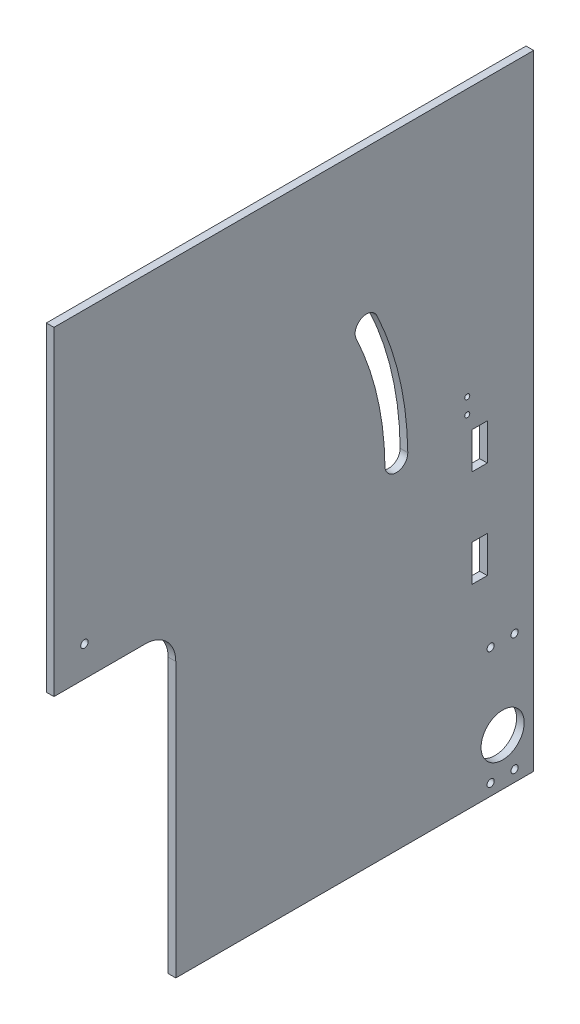
ISO-10303-21;
HEADER;
FILE_DESCRIPTION(('STEP AP214'),'2;1');
FILE_NAME('part.step','',(''),(''),'','','');
FILE_SCHEMA(('AUTOMOTIVE_DESIGN { 1 0 10303 214 1 1 1 1 }'));
ENDSEC;
DATA;
#1=APPLICATION_CONTEXT('core data for automotive mechanical design processes');
#2=APPLICATION_PROTOCOL_DEFINITION('international standard','automotive_design',2000,#1);
#3=PRODUCT_CONTEXT('',#1,'mechanical');
#4=PRODUCT('Part','Part','',(#3));
#5=PRODUCT_RELATED_PRODUCT_CATEGORY('part','',(#4));
#6=PRODUCT_DEFINITION_FORMATION('','',#4);
#7=PRODUCT_DEFINITION_CONTEXT('part definition',#1,'design');
#8=PRODUCT_DEFINITION('design','',#6,#7);
#9=PRODUCT_DEFINITION_SHAPE('','',#8);
#10=(LENGTH_UNIT() NAMED_UNIT(*) SI_UNIT(.MILLI.,.METRE.));
#11=(NAMED_UNIT(*) PLANE_ANGLE_UNIT() SI_UNIT($,.RADIAN.));
#12=(NAMED_UNIT(*) SI_UNIT($,.STERADIAN.) SOLID_ANGLE_UNIT());
#13=UNCERTAINTY_MEASURE_WITH_UNIT(LENGTH_MEASURE(1.E-05),#10,'distance_accuracy_value','');
#14=(GEOMETRIC_REPRESENTATION_CONTEXT(3) GLOBAL_UNCERTAINTY_ASSIGNED_CONTEXT((#13)) GLOBAL_UNIT_ASSIGNED_CONTEXT((#10,
#11,#12)) REPRESENTATION_CONTEXT('',''));
#15=CARTESIAN_POINT('',(0.,0.,0.));
#16=DIRECTION('',(0.,0.,1.));
#17=DIRECTION('',(1.,0.,0.));
#18=AXIS2_PLACEMENT_3D('',#15,#16,#17);
#19=CARTESIAN_POINT('',(3.175,0.,0.));
#20=DIRECTION('',(1.,0.,0.));
#21=DIRECTION('',(0.,0.,-1.));
#22=AXIS2_PLACEMENT_3D('',#19,#20,#21);
#23=PLANE('',#22);
#24=CARTESIAN_POINT('',(3.175,-76.4125,-82.075));
#25=DIRECTION('',(1.,0.,0.));
#26=DIRECTION('',(0.,0.,-1.));
#27=AXIS2_PLACEMENT_3D('',#24,#25,#26);
#28=CIRCLE('',#27,1.5);
#29=CARTESIAN_POINT('',(3.175,-76.4125,-83.575));
#30=VERTEX_POINT('',#29);
#31=EDGE_CURVE('E771',#30,#30,#28,.T.);
#32=ORIENTED_EDGE('',*,*,#31,.F.);
#33=EDGE_LOOP('',(#32));
#34=FACE_BOUND('',#33,.T.);
#35=CARTESIAN_POINT('',(3.175,-125.4125,-92.075));
#36=DIRECTION('',(1.,0.,0.));
#37=DIRECTION('',(0.,0.,-1.));
#38=AXIS2_PLACEMENT_3D('',#35,#36,#37);
#39=CIRCLE('',#38,1.5);
#40=CARTESIAN_POINT('',(3.175,-125.4125,-93.575));
#41=VERTEX_POINT('',#40);
#42=EDGE_CURVE('E780',#41,#41,#39,.T.);
#43=ORIENTED_EDGE('',*,*,#42,.F.);
#44=EDGE_LOOP('',(#43));
#45=FACE_BOUND('',#44,.T.);
#46=CARTESIAN_POINT('',(3.175,-76.4125,-92.075));
#47=DIRECTION('',(1.,0.,0.));
#48=DIRECTION('',(0.,0.,-1.));
#49=AXIS2_PLACEMENT_3D('',#46,#47,#48);
#50=CIRCLE('',#49,1.5);
#51=CARTESIAN_POINT('',(3.175,-76.4125,-93.575));
#52=VERTEX_POINT('',#51);
#53=EDGE_CURVE('E846',#52,#52,#50,.T.);
#54=ORIENTED_EDGE('',*,*,#53,.F.);
#55=EDGE_LOOP('',(#54));
#56=FACE_BOUND('',#55,.T.);
#57=CARTESIAN_POINT('',(3.175,-110.5624916,-87.075));
#58=DIRECTION('',(1.,0.,0.));
#59=DIRECTION('',(0.,0.,-1.));
#60=AXIS2_PLACEMENT_3D('',#57,#58,#59);
#61=CIRCLE('',#60,8.99999999999999);
#62=CARTESIAN_POINT('',(3.175,-110.5624916,-96.075));
#63=VERTEX_POINT('',#62);
#64=EDGE_CURVE('E858',#63,#63,#61,.T.);
#65=ORIENTED_EDGE('',*,*,#64,.F.);
#66=EDGE_LOOP('',(#65));
#67=FACE_BOUND('',#66,.T.);
#68=CARTESIAN_POINT('',(3.175,-125.4125,-82.075));
#69=DIRECTION('',(1.,0.,0.));
#70=DIRECTION('',(0.,0.,-1.));
#71=AXIS2_PLACEMENT_3D('',#68,#69,#70);
#72=CIRCLE('',#71,1.5);
#73=CARTESIAN_POINT('',(3.175,-125.4125,-83.575));
#74=VERTEX_POINT('',#73);
#75=EDGE_CURVE('E202',#74,#74,#72,.T.);
#76=ORIENTED_EDGE('',*,*,#75,.F.);
#77=EDGE_LOOP('',(#76));
#78=FACE_BOUND('',#77,.T.);
#79=DIRECTION('',(0.,-1.,0.));
#80=VECTOR('',#79,1.);
#81=CARTESIAN_POINT('',(3.175,6.07499420000002,-74.3175));
#82=LINE('',#81,#80);
#83=CARTESIAN_POINT('',(3.175,6.07499420000002,-74.3175));
#84=VERTEX_POINT('',#83);
#85=CARTESIAN_POINT('',(3.175,-9.16500579999998,-74.3175));
#86=VERTEX_POINT('',#85);
#87=EDGE_CURVE('E55',#84,#86,#82,.T.);
#88=ORIENTED_EDGE('',*,*,#87,.F.);
#89=DIRECTION('',(0.,0.,1.));
#90=VECTOR('',#89,1.);
#91=CARTESIAN_POINT('',(3.175,6.07499420000002,-74.3175));
#92=LINE('',#91,#90);
#93=CARTESIAN_POINT('',(3.175,6.07499420000002,-80.6675));
#94=VERTEX_POINT('',#93);
#95=EDGE_CURVE('E194',#94,#84,#92,.T.);
#96=ORIENTED_EDGE('',*,*,#95,.F.);
#97=DIRECTION('',(0.,1.,0.));
#98=VECTOR('',#97,1.);
#99=CARTESIAN_POINT('',(3.175,6.07499420000002,-80.6675));
#100=LINE('',#99,#98);
#101=CARTESIAN_POINT('',(3.175,-9.16500579999998,-80.6675));
#102=VERTEX_POINT('',#101);
#103=EDGE_CURVE('E199',#102,#94,#100,.T.);
#104=ORIENTED_EDGE('',*,*,#103,.F.);
#105=DIRECTION('',(0.,0.,-1.));
#106=VECTOR('',#105,1.);
#107=CARTESIAN_POINT('',(3.175,-9.16500579999998,-74.3175));
#108=LINE('',#107,#106);
#109=EDGE_CURVE('E211',#86,#102,#108,.T.);
#110=ORIENTED_EDGE('',*,*,#109,.F.);
#111=EDGE_LOOP('',(#88,#96,#104,#110));
#112=FACE_BOUND('',#111,.T.);
#113=DIRECTION('',(0.,-1.,0.));
#114=VECTOR('',#113,1.);
#115=CARTESIAN_POINT('',(3.175,-34.5650058,-74.3175));
#116=LINE('',#115,#114);
#117=CARTESIAN_POINT('',(3.175,-34.5650058,-74.3175));
#118=VERTEX_POINT('',#117);
#119=CARTESIAN_POINT('',(3.175,-49.8050058,-74.3175));
#120=VERTEX_POINT('',#119);
#121=EDGE_CURVE('E63',#118,#120,#116,.T.);
#122=ORIENTED_EDGE('',*,*,#121,.F.);
#123=DIRECTION('',(0.,0.,1.));
#124=VECTOR('',#123,1.);
#125=CARTESIAN_POINT('',(3.175,-34.5650058,-74.3175));
#126=LINE('',#125,#124);
#127=CARTESIAN_POINT('',(3.175,-34.5650058,-80.6675));
#128=VERTEX_POINT('',#127);
#129=EDGE_CURVE('E232',#128,#118,#126,.T.);
#130=ORIENTED_EDGE('',*,*,#129,.F.);
#131=DIRECTION('',(0.,1.,0.));
#132=VECTOR('',#131,1.);
#133=CARTESIAN_POINT('',(3.175,-34.5650058,-80.6675));
#134=LINE('',#133,#132);
#135=CARTESIAN_POINT('',(3.175,-49.8050058,-80.6675));
#136=VERTEX_POINT('',#135);
#137=EDGE_CURVE('E252',#136,#128,#134,.T.);
#138=ORIENTED_EDGE('',*,*,#137,.F.);
#139=DIRECTION('',(0.,0.,-1.));
#140=VECTOR('',#139,1.);
#141=CARTESIAN_POINT('',(3.175,-49.8050058,-74.3175));
#142=LINE('',#141,#140);
#143=EDGE_CURVE('E247',#120,#136,#142,.T.);
#144=ORIENTED_EDGE('',*,*,#143,.F.);
#145=EDGE_LOOP('',(#122,#130,#138,#144));
#146=FACE_BOUND('',#145,.T.);
#147=CARTESIAN_POINT('',(3.175,12.4249942,-72.3175));
#148=DIRECTION('',(-1.,0.,0.));
#149=DIRECTION('',(0.,0.,1.));
#150=AXIS2_PLACEMENT_3D('',#147,#148,#149);
#151=CIRCLE('',#150,1.04999790000001);
#152=CARTESIAN_POINT('',(3.175,12.4249942,-71.2675021));
#153=VERTEX_POINT('',#152);
#154=EDGE_CURVE('E351',#153,#153,#151,.T.);
#155=ORIENTED_EDGE('',*,*,#154,.T.);
#156=EDGE_LOOP('',(#155));
#157=FACE_BOUND('',#156,.T.);
#158=CARTESIAN_POINT('',(3.175,18.9250066,-72.3175));
#159=DIRECTION('',(-1.,0.,0.));
#160=DIRECTION('',(0.,0.,1.));
#161=AXIS2_PLACEMENT_3D('',#158,#159,#160);
#162=CIRCLE('',#161,1.04999790000001);
#163=CARTESIAN_POINT('',(3.175,18.9250066,-71.2675021));
#164=VERTEX_POINT('',#163);
#165=EDGE_CURVE('E343',#164,#164,#162,.T.);
#166=ORIENTED_EDGE('',*,*,#165,.T.);
#167=EDGE_LOOP('',(#166));
#168=FACE_BOUND('',#167,.T.);
#169=CARTESIAN_POINT('',(3.175,9.52500000000001,87.3125));
#170=DIRECTION('',(-1.,0.,0.));
#171=DIRECTION('',(0.,0.,1.));
#172=AXIS2_PLACEMENT_3D('',#169,#170,#171);
#173=CIRCLE('',#172,1.54999999999999);
#174=CARTESIAN_POINT('',(3.175,9.52500000000001,88.8625));
#175=VERTEX_POINT('',#174);
#176=EDGE_CURVE('E334',#175,#175,#173,.T.);
#177=ORIENTED_EDGE('',*,*,#176,.T.);
#178=EDGE_LOOP('',(#177));
#179=FACE_BOUND('',#178,.T.);
#180=DIRECTION('',(0.,0.,-1.));
#181=VECTOR('',#180,1.);
#182=CARTESIAN_POINT('',(3.175,-3.17499999999999,100.0125));
#183=LINE('',#182,#181);
#184=CARTESIAN_POINT('',(3.175,-3.17499999999999,100.0125));
#185=VERTEX_POINT('',#184);
#186=CARTESIAN_POINT('',(3.175,-3.175,61.9125));
#187=VERTEX_POINT('',#186);
#188=EDGE_CURVE('E313',#185,#187,#183,.T.);
#189=ORIENTED_EDGE('',*,*,#188,.T.);
#190=CARTESIAN_POINT('',(3.175,-15.875,61.9125));
#191=DIRECTION('',(1.,0.,0.));
#192=DIRECTION('',(0.,0.,-1.));
#193=AXIS2_PLACEMENT_3D('',#190,#191,#192);
#194=CIRCLE('',#193,12.7);
#195=CARTESIAN_POINT('',(3.175,-15.875,49.2125));
#196=VERTEX_POINT('',#195);
#197=EDGE_CURVE('E11',#187,#196,#194,.F.);
#198=ORIENTED_EDGE('',*,*,#197,.T.);
#199=DIRECTION('',(0.,-1.,0.));
#200=VECTOR('',#199,1.);
#201=CARTESIAN_POINT('',(3.175,-3.175,49.2125));
#202=LINE('',#201,#200);
#203=CARTESIAN_POINT('',(3.175,-130.175,49.2125));
#204=VERTEX_POINT('',#203);
#205=EDGE_CURVE('E317',#196,#204,#202,.T.);
#206=ORIENTED_EDGE('',*,*,#205,.T.);
#207=DIRECTION('',(0.,0.,-1.));
#208=VECTOR('',#207,1.);
#209=CARTESIAN_POINT('',(3.175,-130.175,100.0125));
#210=LINE('',#209,#208);
#211=CARTESIAN_POINT('',(3.175,-130.175,-100.0125));
#212=VERTEX_POINT('',#211);
#213=EDGE_CURVE('E362',#204,#212,#210,.T.);
#214=ORIENTED_EDGE('',*,*,#213,.T.);
#215=DIRECTION('',(0.,1.,0.));
#216=VECTOR('',#215,1.);
#217=CARTESIAN_POINT('',(3.175,130.175,-100.0125));
#218=LINE('',#217,#216);
#219=CARTESIAN_POINT('',(3.175,130.175,-100.0125));
#220=VERTEX_POINT('',#219);
#221=EDGE_CURVE('E366',#212,#220,#218,.T.);
#222=ORIENTED_EDGE('',*,*,#221,.T.);
#223=DIRECTION('',(0.,0.,1.));
#224=VECTOR('',#223,1.);
#225=CARTESIAN_POINT('',(3.175,130.175,100.0125));
#226=LINE('',#225,#224);
#227=CARTESIAN_POINT('',(3.175,130.175,100.0125));
#228=VERTEX_POINT('',#227);
#229=EDGE_CURVE('E369',#220,#228,#226,.T.);
#230=ORIENTED_EDGE('',*,*,#229,.T.);
#231=DIRECTION('',(0.,-1.,0.));
#232=VECTOR('',#231,1.);
#233=CARTESIAN_POINT('',(3.175,130.175,100.0125));
#234=LINE('',#233,#232);
#235=EDGE_CURVE('E358',#228,#185,#234,.T.);
#236=ORIENTED_EDGE('',*,*,#235,.T.);
#237=EDGE_LOOP('',(#189,#198,#206,#214,#222,#230,#236));
#238=FACE_BOUND('',#237,.T.);
#239=CARTESIAN_POINT('',(3.175,11.0871566045476,-42.7659721455072));
#240=DIRECTION('',(-1.,0.,0.));
#241=DIRECTION('',(0.,0.,1.));
#242=AXIS2_PLACEMENT_3D('',#239,#240,#241);
#243=CIRCLE('',#242,4.76250000000012);
#244=CARTESIAN_POINT('',(3.175,11.1443469625431,-47.5281287486601));
#245=VERTEX_POINT('',#244);
#246=CARTESIAN_POINT('',(3.175,11.0299662465522,-38.0038155423543));
#247=VERTEX_POINT('',#246);
#248=EDGE_CURVE('E269',#245,#247,#243,.T.);
#249=ORIENTED_EDGE('',*,*,#248,.T.);
#250=CARTESIAN_POINT('',(3.175,9.52500000000001,87.3125));
#251=DIRECTION('',(1.,0.,0.));
#252=DIRECTION('',(0.,0.,1.));
#253=AXIS2_PLACEMENT_3D('',#250,#251,#252);
#254=CIRCLE('',#253,125.325352042251);
#255=CARTESIAN_POINT('',(3.175,63.0289480343282,-26.017864021537));
#256=VERTEX_POINT('',#255);
#257=EDGE_CURVE('E273',#247,#256,#254,.T.);
#258=ORIENTED_EDGE('',*,*,#257,.T.);
#259=CARTESIAN_POINT('',(3.175,65.0621566045476,-30.3245412975802));
#260=DIRECTION('',(-1.,0.,0.));
#261=DIRECTION('',(0.,0.,-1.));
#262=AXIS2_PLACEMENT_3D('',#259,#260,#261);
#263=CIRCLE('',#262,4.76249999999999);
#264=CARTESIAN_POINT('',(3.175,67.0953649647199,-34.6312186727879));
#265=VERTEX_POINT('',#264);
#266=EDGE_CURVE('E278',#256,#265,#263,.T.);
#267=ORIENTED_EDGE('',*,*,#266,.T.);
#268=CARTESIAN_POINT('',(3.175,9.52500000000001,87.3125));
#269=DIRECTION('',(-1.,0.,0.));
#270=DIRECTION('',(0.,0.,1.));
#271=AXIS2_PLACEMENT_3D('',#268,#269,#270);
#272=CIRCLE('',#271,134.850352042251);
#273=EDGE_CURVE('E282',#265,#245,#272,.T.);
#274=ORIENTED_EDGE('',*,*,#273,.T.);
#275=EDGE_LOOP('',(#249,#258,#267,#274));
#276=FACE_BOUND('',#275,.T.);
#277=ADVANCED_FACE('F39',(#34,#45,#56,#67,#78,#112,#146,#157,#168,#179,#238,#276),#23,.T.);
#278=CARTESIAN_POINT('',(0.,0.,0.));
#279=DIRECTION('',(1.,0.,0.));
#280=DIRECTION('',(0.,0.,-1.));
#281=AXIS2_PLACEMENT_3D('',#278,#279,#280);
#282=PLANE('',#281);
#283=CARTESIAN_POINT('',(0.,-76.4125,-82.075));
#284=DIRECTION('',(1.,0.,0.));
#285=DIRECTION('',(0.,0.,-1.));
#286=AXIS2_PLACEMENT_3D('',#283,#284,#285);
#287=CIRCLE('',#286,1.5);
#288=CARTESIAN_POINT('',(0.,-76.4125,-83.575));
#289=VERTEX_POINT('',#288);
#290=EDGE_CURVE('E769',#289,#289,#287,.T.);
#291=ORIENTED_EDGE('',*,*,#290,.T.);
#292=EDGE_LOOP('',(#291));
#293=FACE_BOUND('',#292,.T.);
#294=CARTESIAN_POINT('',(0.,-125.4125,-92.075));
#295=DIRECTION('',(1.,0.,0.));
#296=DIRECTION('',(0.,0.,-1.));
#297=AXIS2_PLACEMENT_3D('',#294,#295,#296);
#298=CIRCLE('',#297,1.5);
#299=CARTESIAN_POINT('',(0.,-125.4125,-93.575));
#300=VERTEX_POINT('',#299);
#301=EDGE_CURVE('E773',#300,#300,#298,.T.);
#302=ORIENTED_EDGE('',*,*,#301,.T.);
#303=EDGE_LOOP('',(#302));
#304=FACE_BOUND('',#303,.T.);
#305=CARTESIAN_POINT('',(0.,-76.4125,-92.075));
#306=DIRECTION('',(1.,0.,0.));
#307=DIRECTION('',(0.,0.,-1.));
#308=AXIS2_PLACEMENT_3D('',#305,#306,#307);
#309=CIRCLE('',#308,1.5);
#310=CARTESIAN_POINT('',(0.,-76.4125,-93.575));
#311=VERTEX_POINT('',#310);
#312=EDGE_CURVE('E786',#311,#311,#309,.T.);
#313=ORIENTED_EDGE('',*,*,#312,.T.);
#314=EDGE_LOOP('',(#313));
#315=FACE_BOUND('',#314,.T.);
#316=CARTESIAN_POINT('',(0.,-110.5624916,-87.075));
#317=DIRECTION('',(1.,0.,0.));
#318=DIRECTION('',(0.,0.,-1.));
#319=AXIS2_PLACEMENT_3D('',#316,#317,#318);
#320=CIRCLE('',#319,8.99999999999999);
#321=CARTESIAN_POINT('',(0.,-110.5624916,-96.075));
#322=VERTEX_POINT('',#321);
#323=EDGE_CURVE('E853',#322,#322,#320,.T.);
#324=ORIENTED_EDGE('',*,*,#323,.T.);
#325=EDGE_LOOP('',(#324));
#326=FACE_BOUND('',#325,.T.);
#327=CARTESIAN_POINT('',(0.,-125.4125,-82.075));
#328=DIRECTION('',(1.,0.,0.));
#329=DIRECTION('',(0.,0.,-1.));
#330=AXIS2_PLACEMENT_3D('',#327,#328,#329);
#331=CIRCLE('',#330,1.5);
#332=CARTESIAN_POINT('',(0.,-125.4125,-83.575));
#333=VERTEX_POINT('',#332);
#334=EDGE_CURVE('E248',#333,#333,#331,.T.);
#335=ORIENTED_EDGE('',*,*,#334,.T.);
#336=EDGE_LOOP('',(#335));
#337=FACE_BOUND('',#336,.T.);
#338=DIRECTION('',(0.,0.,1.));
#339=VECTOR('',#338,1.);
#340=CARTESIAN_POINT('',(0.,6.07499420000002,-74.3175));
#341=LINE('',#340,#339);
#342=CARTESIAN_POINT('',(0.,6.07499420000002,-80.6675));
#343=VERTEX_POINT('',#342);
#344=CARTESIAN_POINT('',(0.,6.07499420000002,-74.3175));
#345=VERTEX_POINT('',#344);
#346=EDGE_CURVE('E179',#343,#345,#341,.T.);
#347=ORIENTED_EDGE('',*,*,#346,.T.);
#348=DIRECTION('',(0.,-1.,0.));
#349=VECTOR('',#348,1.);
#350=CARTESIAN_POINT('',(0.,6.07499420000002,-74.3175));
#351=LINE('',#350,#349);
#352=CARTESIAN_POINT('',(0.,-9.16500579999998,-74.3175));
#353=VERTEX_POINT('',#352);
#354=EDGE_CURVE('E172',#345,#353,#351,.T.);
#355=ORIENTED_EDGE('',*,*,#354,.T.);
#356=DIRECTION('',(0.,0.,-1.));
#357=VECTOR('',#356,1.);
#358=CARTESIAN_POINT('',(0.,-9.16500579999998,-74.3175));
#359=LINE('',#358,#357);
#360=CARTESIAN_POINT('',(0.,-9.16500579999998,-80.6675));
#361=VERTEX_POINT('',#360);
#362=EDGE_CURVE('E183',#353,#361,#359,.T.);
#363=ORIENTED_EDGE('',*,*,#362,.T.);
#364=DIRECTION('',(0.,1.,0.));
#365=VECTOR('',#364,1.);
#366=CARTESIAN_POINT('',(0.,6.07499420000002,-80.6675));
#367=LINE('',#366,#365);
#368=EDGE_CURVE('E188',#361,#343,#367,.T.);
#369=ORIENTED_EDGE('',*,*,#368,.T.);
#370=EDGE_LOOP('',(#347,#355,#363,#369));
#371=FACE_BOUND('',#370,.T.);
#372=DIRECTION('',(0.,0.,1.));
#373=VECTOR('',#372,1.);
#374=CARTESIAN_POINT('',(0.,-34.5650058,-74.3175));
#375=LINE('',#374,#373);
#376=CARTESIAN_POINT('',(0.,-34.5650058,-80.6675));
#377=VERTEX_POINT('',#376);
#378=CARTESIAN_POINT('',(0.,-34.5650058,-74.3175));
#379=VERTEX_POINT('',#378);
#380=EDGE_CURVE('E240',#377,#379,#375,.T.);
#381=ORIENTED_EDGE('',*,*,#380,.T.);
#382=DIRECTION('',(0.,-1.,0.));
#383=VECTOR('',#382,1.);
#384=CARTESIAN_POINT('',(0.,-34.5650058,-74.3175));
#385=LINE('',#384,#383);
#386=CARTESIAN_POINT('',(0.,-49.8050058,-74.3175));
#387=VERTEX_POINT('',#386);
#388=EDGE_CURVE('E227',#379,#387,#385,.T.);
#389=ORIENTED_EDGE('',*,*,#388,.T.);
#390=DIRECTION('',(0.,0.,-1.));
#391=VECTOR('',#390,1.);
#392=CARTESIAN_POINT('',(0.,-49.8050058,-74.3175));
#393=LINE('',#392,#391);
#394=CARTESIAN_POINT('',(0.,-49.8050058,-80.6675));
#395=VERTEX_POINT('',#394);
#396=EDGE_CURVE('E231',#387,#395,#393,.T.);
#397=ORIENTED_EDGE('',*,*,#396,.T.);
#398=DIRECTION('',(0.,1.,0.));
#399=VECTOR('',#398,1.);
#400=CARTESIAN_POINT('',(0.,-34.5650058,-80.6675));
#401=LINE('',#400,#399);
#402=EDGE_CURVE('E236',#395,#377,#401,.T.);
#403=ORIENTED_EDGE('',*,*,#402,.T.);
#404=EDGE_LOOP('',(#381,#389,#397,#403));
#405=FACE_BOUND('',#404,.T.);
#406=CARTESIAN_POINT('',(0.,9.52500000000001,87.3125));
#407=DIRECTION('',(-1.,0.,0.));
#408=DIRECTION('',(0.,0.,1.));
#409=AXIS2_PLACEMENT_3D('',#406,#407,#408);
#410=CIRCLE('',#409,1.54999999999999);
#411=CARTESIAN_POINT('',(0.,9.52500000000001,88.8625));
#412=VERTEX_POINT('',#411);
#413=EDGE_CURVE('E339',#412,#412,#410,.T.);
#414=ORIENTED_EDGE('',*,*,#413,.F.);
#415=EDGE_LOOP('',(#414));
#416=FACE_BOUND('',#415,.T.);
#417=CARTESIAN_POINT('',(0.,18.9250066,-72.3175));
#418=DIRECTION('',(-1.,0.,0.));
#419=DIRECTION('',(0.,0.,1.));
#420=AXIS2_PLACEMENT_3D('',#417,#418,#419);
#421=CIRCLE('',#420,1.04999790000001);
#422=CARTESIAN_POINT('',(0.,18.9250066,-71.2675021));
#423=VERTEX_POINT('',#422);
#424=EDGE_CURVE('E347',#423,#423,#421,.T.);
#425=ORIENTED_EDGE('',*,*,#424,.F.);
#426=EDGE_LOOP('',(#425));
#427=FACE_BOUND('',#426,.T.);
#428=CARTESIAN_POINT('',(0.,12.4249942,-72.3175));
#429=DIRECTION('',(-1.,0.,0.));
#430=DIRECTION('',(0.,0.,1.));
#431=AXIS2_PLACEMENT_3D('',#428,#429,#430);
#432=CIRCLE('',#431,1.04999790000001);
#433=CARTESIAN_POINT('',(0.,12.4249942,-71.2675021));
#434=VERTEX_POINT('',#433);
#435=EDGE_CURVE('E331',#434,#434,#432,.T.);
#436=ORIENTED_EDGE('',*,*,#435,.F.);
#437=EDGE_LOOP('',(#436));
#438=FACE_BOUND('',#437,.T.);
#439=DIRECTION('',(0.,0.,-1.));
#440=VECTOR('',#439,1.);
#441=CARTESIAN_POINT('',(0.,-130.175,100.0125));
#442=LINE('',#441,#440);
#443=CARTESIAN_POINT('',(0.,-130.175,49.2125));
#444=VERTEX_POINT('',#443);
#445=CARTESIAN_POINT('',(0.,-130.175,-100.0125));
#446=VERTEX_POINT('',#445);
#447=EDGE_CURVE('E376',#444,#446,#442,.T.);
#448=ORIENTED_EDGE('',*,*,#447,.F.);
#449=DIRECTION('',(0.,-1.,0.));
#450=VECTOR('',#449,1.);
#451=CARTESIAN_POINT('',(0.,-3.175,49.2125));
#452=LINE('',#451,#450);
#453=CARTESIAN_POINT('',(0.,-15.875,49.2125));
#454=VERTEX_POINT('',#453);
#455=EDGE_CURVE('E318',#454,#444,#452,.T.);
#456=ORIENTED_EDGE('',*,*,#455,.F.);
#457=CARTESIAN_POINT('',(0.,-15.875,61.9125));
#458=DIRECTION('',(1.,0.,0.));
#459=DIRECTION('',(0.,0.,-1.));
#460=AXIS2_PLACEMENT_3D('',#457,#458,#459);
#461=CIRCLE('',#460,12.7);
#462=CARTESIAN_POINT('',(0.,-3.175,61.9125));
#463=VERTEX_POINT('',#462);
#464=EDGE_CURVE('E48',#454,#463,#461,.T.);
#465=ORIENTED_EDGE('',*,*,#464,.T.);
#466=DIRECTION('',(0.,0.,-1.));
#467=VECTOR('',#466,1.);
#468=CARTESIAN_POINT('',(0.,-3.17499999999999,100.0125));
#469=LINE('',#468,#467);
#470=CARTESIAN_POINT('',(0.,-3.17499999999998,100.0125));
#471=VERTEX_POINT('',#470);
#472=EDGE_CURVE('E303',#471,#463,#469,.T.);
#473=ORIENTED_EDGE('',*,*,#472,.F.);
#474=DIRECTION('',(0.,-1.,0.));
#475=VECTOR('',#474,1.);
#476=CARTESIAN_POINT('',(0.,130.175,100.0125));
#477=LINE('',#476,#475);
#478=CARTESIAN_POINT('',(0.,130.175,100.0125));
#479=VERTEX_POINT('',#478);
#480=EDGE_CURVE('E338',#479,#471,#477,.T.);
#481=ORIENTED_EDGE('',*,*,#480,.F.);
#482=DIRECTION('',(0.,0.,1.));
#483=VECTOR('',#482,1.);
#484=CARTESIAN_POINT('',(0.,130.175,100.0125));
#485=LINE('',#484,#483);
#486=CARTESIAN_POINT('',(0.,130.175,-100.0125));
#487=VERTEX_POINT('',#486);
#488=EDGE_CURVE('E363',#487,#479,#485,.T.);
#489=ORIENTED_EDGE('',*,*,#488,.F.);
#490=DIRECTION('',(0.,1.,0.));
#491=VECTOR('',#490,1.);
#492=CARTESIAN_POINT('',(0.,130.175,-100.0125));
#493=LINE('',#492,#491);
#494=EDGE_CURVE('E379',#446,#487,#493,.T.);
#495=ORIENTED_EDGE('',*,*,#494,.F.);
#496=EDGE_LOOP('',(#448,#456,#465,#473,#481,#489,#495));
#497=FACE_BOUND('',#496,.T.);
#498=CARTESIAN_POINT('',(0.,9.52500000000001,87.3125));
#499=DIRECTION('',(1.,0.,0.));
#500=DIRECTION('',(0.,0.,1.));
#501=AXIS2_PLACEMENT_3D('',#498,#499,#500);
#502=CIRCLE('',#501,125.325352042251);
#503=CARTESIAN_POINT('',(0.,11.0299662465522,-38.0038155423543));
#504=VERTEX_POINT('',#503);
#505=CARTESIAN_POINT('',(0.,63.0289480343283,-26.017864021537));
#506=VERTEX_POINT('',#505);
#507=EDGE_CURVE('E289',#504,#506,#502,.T.);
#508=ORIENTED_EDGE('',*,*,#507,.F.);
#509=CARTESIAN_POINT('',(0.,11.0871566045476,-42.7659721455072));
#510=DIRECTION('',(-1.,0.,0.));
#511=DIRECTION('',(0.,0.,1.));
#512=AXIS2_PLACEMENT_3D('',#509,#510,#511);
#513=CIRCLE('',#512,4.76250000000012);
#514=CARTESIAN_POINT('',(0.,11.1443469625431,-47.5281287486601));
#515=VERTEX_POINT('',#514);
#516=EDGE_CURVE('E221',#515,#504,#513,.T.);
#517=ORIENTED_EDGE('',*,*,#516,.F.);
#518=CARTESIAN_POINT('',(0.,9.52500000000001,87.3125));
#519=DIRECTION('',(-1.,0.,0.));
#520=DIRECTION('',(0.,0.,1.));
#521=AXIS2_PLACEMENT_3D('',#518,#519,#520);
#522=CIRCLE('',#521,134.850352042251);
#523=CARTESIAN_POINT('',(0.,67.0953649647199,-34.6312186727879));
#524=VERTEX_POINT('',#523);
#525=EDGE_CURVE('E274',#524,#515,#522,.T.);
#526=ORIENTED_EDGE('',*,*,#525,.F.);
#527=CARTESIAN_POINT('',(0.,65.0621566045476,-30.3245412975802));
#528=DIRECTION('',(-1.,0.,0.));
#529=DIRECTION('',(0.,0.,-1.));
#530=AXIS2_PLACEMENT_3D('',#527,#528,#529);
#531=CIRCLE('',#530,4.76249999999999);
#532=EDGE_CURVE('E293',#506,#524,#531,.T.);
#533=ORIENTED_EDGE('',*,*,#532,.F.);
#534=EDGE_LOOP('',(#508,#517,#526,#533));
#535=FACE_BOUND('',#534,.T.);
#536=ADVANCED_FACE('F190',(#293,#304,#315,#326,#337,#371,#405,#416,#427,#438,#497,#535),#282,.F.);
#537=CARTESIAN_POINT('',(3.175,130.175,100.0125));
#538=DIRECTION('',(0.,0.,-1.));
#539=DIRECTION('',(-1.,0.,0.));
#540=AXIS2_PLACEMENT_3D('',#537,#538,#539);
#541=PLANE('',#540);
#542=ORIENTED_EDGE('',*,*,#480,.T.);
#543=DIRECTION('',(-1.,0.,0.));
#544=VECTOR('',#543,1.);
#545=CARTESIAN_POINT('',(3.175,-3.17499999999999,100.0125));
#546=LINE('',#545,#544);
#547=EDGE_CURVE('E321',#185,#471,#546,.T.);
#548=ORIENTED_EDGE('',*,*,#547,.F.);
#549=ORIENTED_EDGE('',*,*,#235,.F.);
#550=DIRECTION('',(-1.,0.,0.));
#551=VECTOR('',#550,1.);
#552=CARTESIAN_POINT('',(3.175,130.175,100.0125));
#553=LINE('',#552,#551);
#554=EDGE_CURVE('E372',#228,#479,#553,.T.);
#555=ORIENTED_EDGE('',*,*,#554,.T.);
#556=EDGE_LOOP('',(#542,#548,#549,#555));
#557=FACE_BOUND('',#556,.T.);
#558=ADVANCED_FACE('F438',(#557),#541,.F.);
#559=CARTESIAN_POINT('',(3.175,-130.175,100.0125));
#560=DIRECTION('',(0.,1.,0.));
#561=DIRECTION('',(0.,0.,1.));
#562=AXIS2_PLACEMENT_3D('',#559,#560,#561);
#563=PLANE('',#562);
#564=ORIENTED_EDGE('',*,*,#213,.F.);
#565=DIRECTION('',(-1.,0.,0.));
#566=VECTOR('',#565,1.);
#567=CARTESIAN_POINT('',(3.175,-130.175,49.2125));
#568=LINE('',#567,#566);
#569=EDGE_CURVE('E327',#204,#444,#568,.T.);
#570=ORIENTED_EDGE('',*,*,#569,.T.);
#571=ORIENTED_EDGE('',*,*,#447,.T.);
#572=DIRECTION('',(-1.,0.,0.));
#573=VECTOR('',#572,1.);
#574=CARTESIAN_POINT('',(3.175,-130.175,-100.0125));
#575=LINE('',#574,#573);
#576=EDGE_CURVE('E391',#212,#446,#575,.T.);
#577=ORIENTED_EDGE('',*,*,#576,.F.);
#578=EDGE_LOOP('',(#564,#570,#571,#577));
#579=FACE_BOUND('',#578,.T.);
#580=ADVANCED_FACE('F425',(#579),#563,.F.);
#581=CARTESIAN_POINT('',(3.175,130.175,-100.0125));
#582=DIRECTION('',(0.,0.,1.));
#583=DIRECTION('',(0.,-1.,0.));
#584=AXIS2_PLACEMENT_3D('',#581,#582,#583);
#585=PLANE('',#584);
#586=ORIENTED_EDGE('',*,*,#494,.T.);
#587=DIRECTION('',(-1.,0.,0.));
#588=VECTOR('',#587,1.);
#589=CARTESIAN_POINT('',(3.175,130.175,-100.0125));
#590=LINE('',#589,#588);
#591=EDGE_CURVE('E387',#220,#487,#590,.T.);
#592=ORIENTED_EDGE('',*,*,#591,.F.);
#593=ORIENTED_EDGE('',*,*,#221,.F.);
#594=ORIENTED_EDGE('',*,*,#576,.T.);
#595=EDGE_LOOP('',(#586,#592,#593,#594));
#596=FACE_BOUND('',#595,.T.);
#597=ADVANCED_FACE('F431',(#596),#585,.F.);
#598=CARTESIAN_POINT('',(3.175,130.175,100.0125));
#599=DIRECTION('',(0.,-1.,0.));
#600=DIRECTION('',(0.,0.,-1.));
#601=AXIS2_PLACEMENT_3D('',#598,#599,#600);
#602=PLANE('',#601);
#603=ORIENTED_EDGE('',*,*,#488,.T.);
#604=ORIENTED_EDGE('',*,*,#554,.F.);
#605=ORIENTED_EDGE('',*,*,#229,.F.);
#606=ORIENTED_EDGE('',*,*,#591,.T.);
#607=EDGE_LOOP('',(#603,#604,#605,#606));
#608=FACE_BOUND('',#607,.T.);
#609=ADVANCED_FACE('F435',(#608),#602,.F.);
#610=CARTESIAN_POINT('',(3.175,12.4249942,-72.3175));
#611=DIRECTION('',(-1.,0.,0.));
#612=DIRECTION('',(0.,0.,1.));
#613=AXIS2_PLACEMENT_3D('',#610,#611,#612);
#614=CYLINDRICAL_SURFACE('',#613,1.04999790000001);
#615=ORIENTED_EDGE('',*,*,#154,.F.);
#616=EDGE_LOOP('',(#615));
#617=FACE_BOUND('',#616,.T.);
#618=ORIENTED_EDGE('',*,*,#435,.T.);
#619=EDGE_LOOP('',(#618));
#620=FACE_BOUND('',#619,.T.);
#621=ADVANCED_FACE('F455',(#617,#620),#614,.F.);
#622=CARTESIAN_POINT('',(3.175,18.9250066,-72.3175));
#623=DIRECTION('',(-1.,0.,0.));
#624=DIRECTION('',(0.,0.,1.));
#625=AXIS2_PLACEMENT_3D('',#622,#623,#624);
#626=CYLINDRICAL_SURFACE('',#625,1.04999790000001);
#627=ORIENTED_EDGE('',*,*,#165,.F.);
#628=EDGE_LOOP('',(#627));
#629=FACE_BOUND('',#628,.T.);
#630=ORIENTED_EDGE('',*,*,#424,.T.);
#631=EDGE_LOOP('',(#630));
#632=FACE_BOUND('',#631,.T.);
#633=ADVANCED_FACE('F475',(#629,#632),#626,.F.);
#634=CARTESIAN_POINT('',(3.175,9.52500000000001,87.3125));
#635=DIRECTION('',(-1.,0.,0.));
#636=DIRECTION('',(0.,0.,1.));
#637=AXIS2_PLACEMENT_3D('',#634,#635,#636);
#638=CYLINDRICAL_SURFACE('',#637,1.54999999999999);
#639=ORIENTED_EDGE('',*,*,#176,.F.);
#640=EDGE_LOOP('',(#639));
#641=FACE_BOUND('',#640,.T.);
#642=ORIENTED_EDGE('',*,*,#413,.T.);
#643=EDGE_LOOP('',(#642));
#644=FACE_BOUND('',#643,.T.);
#645=ADVANCED_FACE('F482',(#641,#644),#638,.F.);
#646=CARTESIAN_POINT('',(3.175,-3.175,49.2125));
#647=DIRECTION('',(0.,0.,-1.));
#648=DIRECTION('',(0.,1.,0.));
#649=AXIS2_PLACEMENT_3D('',#646,#647,#648);
#650=PLANE('',#649);
#651=ORIENTED_EDGE('',*,*,#205,.F.);
#652=DIRECTION('',(-1.,0.,0.));
#653=VECTOR('',#652,1.);
#654=CARTESIAN_POINT('',(0.,-15.875,49.2125));
#655=LINE('',#654,#653);
#656=EDGE_CURVE('E395',#196,#454,#655,.T.);
#657=ORIENTED_EDGE('',*,*,#656,.T.);
#658=ORIENTED_EDGE('',*,*,#455,.T.);
#659=ORIENTED_EDGE('',*,*,#569,.F.);
#660=EDGE_LOOP('',(#651,#657,#658,#659));
#661=FACE_BOUND('',#660,.T.);
#662=ADVANCED_FACE('F421',(#661),#650,.F.);
#663=CARTESIAN_POINT('',(3.175,-3.17499999999999,100.0125));
#664=DIRECTION('',(0.,1.,0.));
#665=DIRECTION('',(0.,0.,1.));
#666=AXIS2_PLACEMENT_3D('',#663,#664,#665);
#667=PLANE('',#666);
#668=ORIENTED_EDGE('',*,*,#472,.T.);
#669=DIRECTION('',(-1.,0.,0.));
#670=VECTOR('',#669,1.);
#671=CARTESIAN_POINT('',(3.175,-3.175,61.9125));
#672=LINE('',#671,#670);
#673=EDGE_CURVE('E399',#463,#187,#672,.F.);
#674=ORIENTED_EDGE('',*,*,#673,.T.);
#675=ORIENTED_EDGE('',*,*,#188,.F.);
#676=ORIENTED_EDGE('',*,*,#547,.T.);
#677=EDGE_LOOP('',(#668,#674,#675,#676));
#678=FACE_BOUND('',#677,.T.);
#679=ADVANCED_FACE('F413',(#678),#667,.F.);
#680=CARTESIAN_POINT('',(3.175,-15.875,61.9125));
#681=DIRECTION('',(1.,0.,0.));
#682=DIRECTION('',(0.,0.,-1.));
#683=AXIS2_PLACEMENT_3D('',#680,#681,#682);
#684=CYLINDRICAL_SURFACE('',#683,12.7);
#685=ORIENTED_EDGE('',*,*,#197,.F.);
#686=ORIENTED_EDGE('',*,*,#673,.F.);
#687=ORIENTED_EDGE('',*,*,#464,.F.);
#688=ORIENTED_EDGE('',*,*,#656,.F.);
#689=EDGE_LOOP('',(#685,#686,#687,#688));
#690=FACE_BOUND('',#689,.T.);
#691=ADVANCED_FACE('F41',(#690),#684,.F.);
#692=CARTESIAN_POINT('',(3.175,11.0871566045476,-42.7659721455072));
#693=DIRECTION('',(-1.,0.,0.));
#694=DIRECTION('',(0.,0.,1.));
#695=AXIS2_PLACEMENT_3D('',#692,#693,#694);
#696=CYLINDRICAL_SURFACE('',#695,4.76250000000012);
#697=ORIENTED_EDGE('',*,*,#516,.T.);
#698=DIRECTION('',(-1.,0.,0.));
#699=VECTOR('',#698,1.);
#700=CARTESIAN_POINT('',(3.175,11.0299662465522,-38.0038155423543));
#701=LINE('',#700,#699);
#702=EDGE_CURVE('E286',#247,#504,#701,.T.);
#703=ORIENTED_EDGE('',*,*,#702,.F.);
#704=ORIENTED_EDGE('',*,*,#248,.F.);
#705=DIRECTION('',(-1.,0.,0.));
#706=VECTOR('',#705,1.);
#707=CARTESIAN_POINT('',(3.175,11.1443469625431,-47.5281287486601));
#708=LINE('',#707,#706);
#709=EDGE_CURVE('E300',#245,#515,#708,.T.);
#710=ORIENTED_EDGE('',*,*,#709,.T.);
#711=EDGE_LOOP('',(#697,#703,#704,#710));
#712=FACE_BOUND('',#711,.T.);
#713=ADVANCED_FACE('F508',(#712),#696,.F.);
#714=CARTESIAN_POINT('',(3.175,9.52500000000001,87.3125));
#715=DIRECTION('',(-1.,0.,0.));
#716=DIRECTION('',(0.,0.,1.));
#717=AXIS2_PLACEMENT_3D('',#714,#715,#716);
#718=CYLINDRICAL_SURFACE('',#717,134.850352042251);
#719=ORIENTED_EDGE('',*,*,#525,.T.);
#720=ORIENTED_EDGE('',*,*,#709,.F.);
#721=ORIENTED_EDGE('',*,*,#273,.F.);
#722=DIRECTION('',(-1.,0.,0.));
#723=VECTOR('',#722,1.);
#724=CARTESIAN_POINT('',(3.175,67.0953649647199,-34.6312186727879));
#725=LINE('',#724,#723);
#726=EDGE_CURVE('E304',#265,#524,#725,.T.);
#727=ORIENTED_EDGE('',*,*,#726,.T.);
#728=EDGE_LOOP('',(#719,#720,#721,#727));
#729=FACE_BOUND('',#728,.T.);
#730=ADVANCED_FACE('F514',(#729),#718,.F.);
#731=CARTESIAN_POINT('',(3.175,65.0621566045476,-30.3245412975802));
#732=DIRECTION('',(-1.,0.,0.));
#733=DIRECTION('',(0.,0.,1.));
#734=AXIS2_PLACEMENT_3D('',#731,#732,#733);
#735=CYLINDRICAL_SURFACE('',#734,4.76249999999999);
#736=ORIENTED_EDGE('',*,*,#532,.T.);
#737=ORIENTED_EDGE('',*,*,#726,.F.);
#738=ORIENTED_EDGE('',*,*,#266,.F.);
#739=DIRECTION('',(-1.,0.,0.));
#740=VECTOR('',#739,1.);
#741=CARTESIAN_POINT('',(3.175,63.0289480343283,-26.017864021537));
#742=LINE('',#741,#740);
#743=EDGE_CURVE('E307',#256,#506,#742,.T.);
#744=ORIENTED_EDGE('',*,*,#743,.T.);
#745=EDGE_LOOP('',(#736,#737,#738,#744));
#746=FACE_BOUND('',#745,.T.);
#747=ADVANCED_FACE('F522',(#746),#735,.F.);
#748=CARTESIAN_POINT('',(3.175,9.52500000000001,87.3125));
#749=DIRECTION('',(-1.,0.,0.));
#750=DIRECTION('',(0.,0.,1.));
#751=AXIS2_PLACEMENT_3D('',#748,#749,#750);
#752=CYLINDRICAL_SURFACE('',#751,125.325352042251);
#753=ORIENTED_EDGE('',*,*,#507,.T.);
#754=ORIENTED_EDGE('',*,*,#743,.F.);
#755=ORIENTED_EDGE('',*,*,#257,.F.);
#756=ORIENTED_EDGE('',*,*,#702,.T.);
#757=EDGE_LOOP('',(#753,#754,#755,#756));
#758=FACE_BOUND('',#757,.T.);
#759=ADVANCED_FACE('F530',(#758),#752,.T.);
#760=CARTESIAN_POINT('',(0.,-34.5650058,-74.3175));
#761=DIRECTION('',(0.,0.,1.));
#762=DIRECTION('',(1.,0.,0.));
#763=AXIS2_PLACEMENT_3D('',#760,#761,#762);
#764=PLANE('',#763);
#765=ORIENTED_EDGE('',*,*,#121,.T.);
#766=DIRECTION('',(1.,0.,0.));
#767=VECTOR('',#766,1.);
#768=CARTESIAN_POINT('',(0.,-49.8050058,-74.3175));
#769=LINE('',#768,#767);
#770=EDGE_CURVE('E244',#387,#120,#769,.T.);
#771=ORIENTED_EDGE('',*,*,#770,.F.);
#772=ORIENTED_EDGE('',*,*,#388,.F.);
#773=DIRECTION('',(1.,0.,0.));
#774=VECTOR('',#773,1.);
#775=CARTESIAN_POINT('',(0.,-34.5650058,-74.3175));
#776=LINE('',#775,#774);
#777=EDGE_CURVE('E212',#379,#118,#776,.T.);
#778=ORIENTED_EDGE('',*,*,#777,.T.);
#779=EDGE_LOOP('',(#765,#771,#772,#778));
#780=FACE_BOUND('',#779,.T.);
#781=ADVANCED_FACE('F538',(#780),#764,.F.);
#782=CARTESIAN_POINT('',(0.,-34.5650058,-74.3175));
#783=DIRECTION('',(0.,1.,0.));
#784=DIRECTION('',(0.,0.,1.));
#785=AXIS2_PLACEMENT_3D('',#782,#783,#784);
#786=PLANE('',#785);
#787=ORIENTED_EDGE('',*,*,#129,.T.);
#788=ORIENTED_EDGE('',*,*,#777,.F.);
#789=ORIENTED_EDGE('',*,*,#380,.F.);
#790=DIRECTION('',(1.,0.,0.));
#791=VECTOR('',#790,1.);
#792=CARTESIAN_POINT('',(0.,-34.5650058,-80.6675));
#793=LINE('',#792,#791);
#794=EDGE_CURVE('E261',#377,#128,#793,.T.);
#795=ORIENTED_EDGE('',*,*,#794,.T.);
#796=EDGE_LOOP('',(#787,#788,#789,#795));
#797=FACE_BOUND('',#796,.T.);
#798=ADVANCED_FACE('F546',(#797),#786,.F.);
#799=CARTESIAN_POINT('',(0.,-34.5650058,-80.6675));
#800=DIRECTION('',(0.,0.,-1.));
#801=DIRECTION('',(-1.,0.,0.));
#802=AXIS2_PLACEMENT_3D('',#799,#800,#801);
#803=PLANE('',#802);
#804=ORIENTED_EDGE('',*,*,#137,.T.);
#805=ORIENTED_EDGE('',*,*,#794,.F.);
#806=ORIENTED_EDGE('',*,*,#402,.F.);
#807=DIRECTION('',(1.,0.,0.));
#808=VECTOR('',#807,1.);
#809=CARTESIAN_POINT('',(0.,-49.8050058,-80.6675));
#810=LINE('',#809,#808);
#811=EDGE_CURVE('E264',#395,#136,#810,.T.);
#812=ORIENTED_EDGE('',*,*,#811,.T.);
#813=EDGE_LOOP('',(#804,#805,#806,#812));
#814=FACE_BOUND('',#813,.T.);
#815=ADVANCED_FACE('F553',(#814),#803,.F.);
#816=CARTESIAN_POINT('',(0.,-49.8050058,-74.3175));
#817=DIRECTION('',(0.,-1.,0.));
#818=DIRECTION('',(0.,0.,-1.));
#819=AXIS2_PLACEMENT_3D('',#816,#817,#818);
#820=PLANE('',#819);
#821=ORIENTED_EDGE('',*,*,#143,.T.);
#822=ORIENTED_EDGE('',*,*,#811,.F.);
#823=ORIENTED_EDGE('',*,*,#396,.F.);
#824=ORIENTED_EDGE('',*,*,#770,.T.);
#825=EDGE_LOOP('',(#821,#822,#823,#824));
#826=FACE_BOUND('',#825,.T.);
#827=ADVANCED_FACE('F561',(#826),#820,.F.);
#828=CARTESIAN_POINT('',(0.,6.07499420000002,-74.3175));
#829=DIRECTION('',(0.,0.,1.));
#830=DIRECTION('',(1.,0.,0.));
#831=AXIS2_PLACEMENT_3D('',#828,#829,#830);
#832=PLANE('',#831);
#833=ORIENTED_EDGE('',*,*,#87,.T.);
#834=DIRECTION('',(1.,0.,0.));
#835=VECTOR('',#834,1.);
#836=CARTESIAN_POINT('',(0.,-9.16500579999998,-74.3175));
#837=LINE('',#836,#835);
#838=EDGE_CURVE('E168',#353,#86,#837,.T.);
#839=ORIENTED_EDGE('',*,*,#838,.F.);
#840=ORIENTED_EDGE('',*,*,#354,.F.);
#841=DIRECTION('',(1.,0.,0.));
#842=VECTOR('',#841,1.);
#843=CARTESIAN_POINT('',(0.,6.07499420000002,-74.3175));
#844=LINE('',#843,#842);
#845=EDGE_CURVE('E218',#345,#84,#844,.T.);
#846=ORIENTED_EDGE('',*,*,#845,.T.);
#847=EDGE_LOOP('',(#833,#839,#840,#846));
#848=FACE_BOUND('',#847,.T.);
#849=ADVANCED_FACE('F170',(#848),#832,.F.);
#850=CARTESIAN_POINT('',(0.,6.07499420000002,-74.3175));
#851=DIRECTION('',(0.,1.,0.));
#852=DIRECTION('',(0.,0.,1.));
#853=AXIS2_PLACEMENT_3D('',#850,#851,#852);
#854=PLANE('',#853);
#855=ORIENTED_EDGE('',*,*,#95,.T.);
#856=ORIENTED_EDGE('',*,*,#845,.F.);
#857=ORIENTED_EDGE('',*,*,#346,.F.);
#858=DIRECTION('',(1.,0.,0.));
#859=VECTOR('',#858,1.);
#860=CARTESIAN_POINT('',(0.,6.07499420000002,-80.6675));
#861=LINE('',#860,#859);
#862=EDGE_CURVE('E222',#343,#94,#861,.T.);
#863=ORIENTED_EDGE('',*,*,#862,.T.);
#864=EDGE_LOOP('',(#855,#856,#857,#863));
#865=FACE_BOUND('',#864,.T.);
#866=ADVANCED_FACE('F576',(#865),#854,.F.);
#867=CARTESIAN_POINT('',(0.,6.07499420000002,-80.6675));
#868=DIRECTION('',(0.,0.,-1.));
#869=DIRECTION('',(-1.,0.,0.));
#870=AXIS2_PLACEMENT_3D('',#867,#868,#869);
#871=PLANE('',#870);
#872=ORIENTED_EDGE('',*,*,#103,.T.);
#873=ORIENTED_EDGE('',*,*,#862,.F.);
#874=ORIENTED_EDGE('',*,*,#368,.F.);
#875=DIRECTION('',(1.,0.,0.));
#876=VECTOR('',#875,1.);
#877=CARTESIAN_POINT('',(0.,-9.16500579999998,-80.6675));
#878=LINE('',#877,#876);
#879=EDGE_CURVE('E178',#361,#102,#878,.T.);
#880=ORIENTED_EDGE('',*,*,#879,.T.);
#881=EDGE_LOOP('',(#872,#873,#874,#880));
#882=FACE_BOUND('',#881,.T.);
#883=ADVANCED_FACE('F583',(#882),#871,.F.);
#884=CARTESIAN_POINT('',(0.,-9.16500579999998,-74.3175));
#885=DIRECTION('',(0.,-1.,0.));
#886=DIRECTION('',(0.,0.,-1.));
#887=AXIS2_PLACEMENT_3D('',#884,#885,#886);
#888=PLANE('',#887);
#889=ORIENTED_EDGE('',*,*,#109,.T.);
#890=ORIENTED_EDGE('',*,*,#879,.F.);
#891=ORIENTED_EDGE('',*,*,#362,.F.);
#892=ORIENTED_EDGE('',*,*,#838,.T.);
#893=EDGE_LOOP('',(#889,#890,#891,#892));
#894=FACE_BOUND('',#893,.T.);
#895=ADVANCED_FACE('F184',(#894),#888,.F.);
#896=CARTESIAN_POINT('',(0.,-125.4125,-82.075));
#897=DIRECTION('',(1.,0.,0.));
#898=DIRECTION('',(0.,0.,-1.));
#899=AXIS2_PLACEMENT_3D('',#896,#897,#898);
#900=CYLINDRICAL_SURFACE('',#899,1.5);
#901=ORIENTED_EDGE('',*,*,#334,.F.);
#902=EDGE_LOOP('',(#901));
#903=FACE_BOUND('',#902,.T.);
#904=ORIENTED_EDGE('',*,*,#75,.T.);
#905=EDGE_LOOP('',(#904));
#906=FACE_BOUND('',#905,.T.);
#907=ADVANCED_FACE('F598',(#903,#906),#900,.F.);
#908=CARTESIAN_POINT('',(0.,-110.5624916,-87.075));
#909=DIRECTION('',(1.,0.,0.));
#910=DIRECTION('',(0.,0.,-1.));
#911=AXIS2_PLACEMENT_3D('',#908,#909,#910);
#912=CYLINDRICAL_SURFACE('',#911,8.99999999999999);
#913=ORIENTED_EDGE('',*,*,#323,.F.);
#914=EDGE_LOOP('',(#913));
#915=FACE_BOUND('',#914,.T.);
#916=ORIENTED_EDGE('',*,*,#64,.T.);
#917=EDGE_LOOP('',(#916));
#918=FACE_BOUND('',#917,.T.);
#919=ADVANCED_FACE('F605',(#915,#918),#912,.F.);
#920=CARTESIAN_POINT('',(0.,-76.4125,-92.075));
#921=DIRECTION('',(1.,0.,0.));
#922=DIRECTION('',(0.,0.,-1.));
#923=AXIS2_PLACEMENT_3D('',#920,#921,#922);
#924=CYLINDRICAL_SURFACE('',#923,1.5);
#925=ORIENTED_EDGE('',*,*,#312,.F.);
#926=EDGE_LOOP('',(#925));
#927=FACE_BOUND('',#926,.T.);
#928=ORIENTED_EDGE('',*,*,#53,.T.);
#929=EDGE_LOOP('',(#928));
#930=FACE_BOUND('',#929,.T.);
#931=ADVANCED_FACE('F613',(#927,#930),#924,.F.);
#932=CARTESIAN_POINT('',(0.,-125.4125,-92.075));
#933=DIRECTION('',(1.,0.,0.));
#934=DIRECTION('',(0.,0.,-1.));
#935=AXIS2_PLACEMENT_3D('',#932,#933,#934);
#936=CYLINDRICAL_SURFACE('',#935,1.5);
#937=ORIENTED_EDGE('',*,*,#301,.F.);
#938=EDGE_LOOP('',(#937));
#939=FACE_BOUND('',#938,.T.);
#940=ORIENTED_EDGE('',*,*,#42,.T.);
#941=EDGE_LOOP('',(#940));
#942=FACE_BOUND('',#941,.T.);
#943=ADVANCED_FACE('F621',(#939,#942),#936,.F.);
#944=CARTESIAN_POINT('',(0.,-76.4125,-82.075));
#945=DIRECTION('',(1.,0.,0.));
#946=DIRECTION('',(0.,0.,-1.));
#947=AXIS2_PLACEMENT_3D('',#944,#945,#946);
#948=CYLINDRICAL_SURFACE('',#947,1.5);
#949=ORIENTED_EDGE('',*,*,#290,.F.);
#950=EDGE_LOOP('',(#949));
#951=FACE_BOUND('',#950,.T.);
#952=ORIENTED_EDGE('',*,*,#31,.T.);
#953=EDGE_LOOP('',(#952));
#954=FACE_BOUND('',#953,.T.);
#955=ADVANCED_FACE('F629',(#951,#954),#948,.F.);
#956=CLOSED_SHELL('',(#277,#536,#558,#580,#597,#609,#621,#633,#645,#662,#679,#691,#713,#730,
#747,#759,#781,#798,#815,#827,#849,#866,#883,#895,#907,#919,#931,#943,#955));
#957=MANIFOLD_SOLID_BREP('B2',#956);
#958=ADVANCED_BREP_SHAPE_REPRESENTATION('',(#18,#957),#14);
#959=SHAPE_DEFINITION_REPRESENTATION(#9,#958);
ENDSEC;
END-ISO-10303-21;
